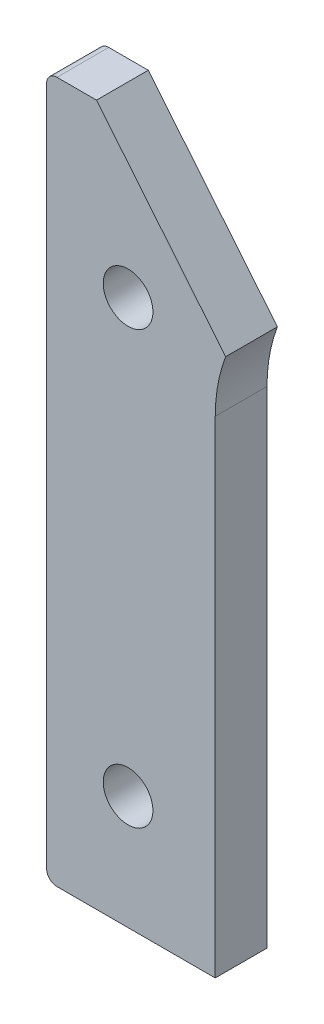
ISO-10303-21;
HEADER;
FILE_DESCRIPTION(('STEP AP214'),'2;1');
FILE_NAME('part.step','',(''),(''),'','','');
FILE_SCHEMA(('AUTOMOTIVE_DESIGN { 1 0 10303 214 1 1 1 1 }'));
ENDSEC;
DATA;
#1=APPLICATION_CONTEXT('core data for automotive mechanical design processes');
#2=APPLICATION_PROTOCOL_DEFINITION('international standard','automotive_design',2000,#1);
#3=PRODUCT_CONTEXT('',#1,'mechanical');
#4=PRODUCT('Part','Part','',(#3));
#5=PRODUCT_RELATED_PRODUCT_CATEGORY('part','',(#4));
#6=PRODUCT_DEFINITION_FORMATION('','',#4);
#7=PRODUCT_DEFINITION_CONTEXT('part definition',#1,'design');
#8=PRODUCT_DEFINITION('design','',#6,#7);
#9=PRODUCT_DEFINITION_SHAPE('','',#8);
#10=(LENGTH_UNIT() NAMED_UNIT(*) SI_UNIT(.MILLI.,.METRE.));
#11=(NAMED_UNIT(*) PLANE_ANGLE_UNIT() SI_UNIT($,.RADIAN.));
#12=(NAMED_UNIT(*) SI_UNIT($,.STERADIAN.) SOLID_ANGLE_UNIT());
#13=UNCERTAINTY_MEASURE_WITH_UNIT(LENGTH_MEASURE(1.E-05),#10,'distance_accuracy_value','');
#14=(GEOMETRIC_REPRESENTATION_CONTEXT(3) GLOBAL_UNCERTAINTY_ASSIGNED_CONTEXT((#13)) GLOBAL_UNIT_ASSIGNED_CONTEXT((#10,
#11,#12)) REPRESENTATION_CONTEXT('',''));
#15=CARTESIAN_POINT('',(0.,0.,0.));
#16=DIRECTION('',(0.,0.,1.));
#17=DIRECTION('',(1.,0.,0.));
#18=AXIS2_PLACEMENT_3D('',#15,#16,#17);
#19=CARTESIAN_POINT('',(-40.3774369352808,0.,6.35));
#20=DIRECTION('',(-1.,0.,0.));
#21=DIRECTION('',(0.,0.,1.));
#22=AXIS2_PLACEMENT_3D('',#19,#20,#21);
#23=PLANE('',#22);
#24=DIRECTION('',(0.,1.,0.));
#25=VECTOR('',#24,1.);
#26=CARTESIAN_POINT('',(-40.3774369352808,0.,0.));
#27=LINE('',#26,#25);
#28=CARTESIAN_POINT('',(-40.3774369352808,-58.42,0.));
#29=VERTEX_POINT('',#28);
#30=CARTESIAN_POINT('',(-40.3774369352808,25.0423969023602,0.));
#31=VERTEX_POINT('',#30);
#32=EDGE_CURVE('E153',#29,#31,#27,.T.);
#33=ORIENTED_EDGE('',*,*,#32,.F.);
#34=DIRECTION('',(0.,0.,-1.));
#35=VECTOR('',#34,1.);
#36=CARTESIAN_POINT('',(-40.3774369352808,-58.42,6.35));
#37=LINE('',#36,#35);
#38=CARTESIAN_POINT('',(-40.3774369352808,-58.42,6.35));
#39=VERTEX_POINT('',#38);
#40=EDGE_CURVE('E11',#39,#29,#37,.T.);
#41=ORIENTED_EDGE('',*,*,#40,.F.);
#42=DIRECTION('',(0.,1.,0.));
#43=VECTOR('',#42,1.);
#44=CARTESIAN_POINT('',(-40.3774369352808,0.,6.35));
#45=LINE('',#44,#43);
#46=CARTESIAN_POINT('',(-40.3774369352808,25.0423969023602,6.35));
#47=VERTEX_POINT('',#46);
#48=EDGE_CURVE('E188',#39,#47,#45,.T.);
#49=ORIENTED_EDGE('',*,*,#48,.T.);
#50=DIRECTION('',(0.,0.,-1.));
#51=VECTOR('',#50,1.);
#52=CARTESIAN_POINT('',(-40.3774369352808,25.0423969023602,6.35));
#53=LINE('',#52,#51);
#54=EDGE_CURVE('E62',#47,#31,#53,.T.);
#55=ORIENTED_EDGE('',*,*,#54,.T.);
#56=EDGE_LOOP('',(#33,#41,#49,#55));
#57=FACE_BOUND('',#56,.T.);
#58=ADVANCED_FACE('F45',(#57),#23,.T.);
#59=CARTESIAN_POINT('',(-39.1074369352808,-58.42,6.35));
#60=DIRECTION('',(0.,0.,-1.));
#61=DIRECTION('',(-1.,0.,0.));
#62=AXIS2_PLACEMENT_3D('',#59,#60,#61);
#63=CYLINDRICAL_SURFACE('',#62,1.27);
#64=CARTESIAN_POINT('',(-39.1074369352808,-58.42,0.));
#65=DIRECTION('',(0.,0.,1.));
#66=DIRECTION('',(1.,0.,0.));
#67=AXIS2_PLACEMENT_3D('',#64,#65,#66);
#68=CIRCLE('',#67,1.27);
#69=CARTESIAN_POINT('',(-39.1074369352808,-59.69,0.));
#70=VERTEX_POINT('',#69);
#71=EDGE_CURVE('E156',#29,#70,#68,.T.);
#72=ORIENTED_EDGE('',*,*,#71,.T.);
#73=DIRECTION('',(0.,0.,-1.));
#74=VECTOR('',#73,1.);
#75=CARTESIAN_POINT('',(-39.1074369352808,-59.69,6.35));
#76=LINE('',#75,#74);
#77=CARTESIAN_POINT('',(-39.1074369352808,-59.69,6.35));
#78=VERTEX_POINT('',#77);
#79=EDGE_CURVE('E54',#78,#70,#76,.T.);
#80=ORIENTED_EDGE('',*,*,#79,.F.);
#81=CARTESIAN_POINT('',(-39.1074369352808,-58.42,6.35));
#82=DIRECTION('',(0.,0.,1.));
#83=DIRECTION('',(1.,0.,0.));
#84=AXIS2_PLACEMENT_3D('',#81,#82,#83);
#85=CIRCLE('',#84,1.27);
#86=EDGE_CURVE('E224',#39,#78,#85,.T.);
#87=ORIENTED_EDGE('',*,*,#86,.F.);
#88=ORIENTED_EDGE('',*,*,#40,.T.);
#89=EDGE_LOOP('',(#72,#80,#87,#88));
#90=FACE_BOUND('',#89,.T.);
#91=ADVANCED_FACE('F245',(#90),#63,.T.);
#92=CARTESIAN_POINT('',(0.,-59.69,6.35));
#93=DIRECTION('',(0.,1.,0.));
#94=DIRECTION('',(0.,0.,1.));
#95=AXIS2_PLACEMENT_3D('',#92,#93,#94);
#96=PLANE('',#95);
#97=DIRECTION('',(1.,0.,0.));
#98=VECTOR('',#97,1.);
#99=CARTESIAN_POINT('',(0.,-59.69,0.));
#100=LINE('',#99,#98);
#101=CARTESIAN_POINT('',(-19.685,-59.69,0.));
#102=VERTEX_POINT('',#101);
#103=EDGE_CURVE('E159',#70,#102,#100,.T.);
#104=ORIENTED_EDGE('',*,*,#103,.T.);
#105=DIRECTION('',(0.,0.,-1.));
#106=VECTOR('',#105,1.);
#107=CARTESIAN_POINT('',(-19.685,-59.69,6.35));
#108=LINE('',#107,#106);
#109=CARTESIAN_POINT('',(-19.685,-59.69,6.35));
#110=VERTEX_POINT('',#109);
#111=EDGE_CURVE('E198',#110,#102,#108,.T.);
#112=ORIENTED_EDGE('',*,*,#111,.F.);
#113=DIRECTION('',(1.,0.,0.));
#114=VECTOR('',#113,1.);
#115=CARTESIAN_POINT('',(0.,-59.69,6.35));
#116=LINE('',#115,#114);
#117=EDGE_CURVE('E208',#78,#110,#116,.T.);
#118=ORIENTED_EDGE('',*,*,#117,.F.);
#119=ORIENTED_EDGE('',*,*,#79,.T.);
#120=EDGE_LOOP('',(#104,#112,#118,#119));
#121=FACE_BOUND('',#120,.T.);
#122=ADVANCED_FACE('F206',(#121),#96,.F.);
#123=CARTESIAN_POINT('',(-19.685,0.,6.35));
#124=DIRECTION('',(1.,0.,0.));
#125=DIRECTION('',(0.,1.,0.));
#126=AXIS2_PLACEMENT_3D('',#123,#124,#125);
#127=PLANE('',#126);
#128=DIRECTION('',(0.,-1.,0.));
#129=VECTOR('',#128,1.);
#130=CARTESIAN_POINT('',(-19.685,0.,0.));
#131=LINE('',#130,#129);
#132=CARTESIAN_POINT('',(-19.685,0.,0.));
#133=VERTEX_POINT('',#132);
#134=EDGE_CURVE('E163',#133,#102,#131,.T.);
#135=ORIENTED_EDGE('',*,*,#134,.F.);
#136=DIRECTION('',(0.,0.,-1.));
#137=VECTOR('',#136,1.);
#138=CARTESIAN_POINT('',(-19.685,0.,6.35));
#139=LINE('',#138,#137);
#140=CARTESIAN_POINT('',(-19.685,0.,6.35));
#141=VERTEX_POINT('',#140);
#142=EDGE_CURVE('E195',#141,#133,#139,.T.);
#143=ORIENTED_EDGE('',*,*,#142,.F.);
#144=DIRECTION('',(0.,-1.,0.));
#145=VECTOR('',#144,1.);
#146=CARTESIAN_POINT('',(-19.685,0.,6.35));
#147=LINE('',#146,#145);
#148=EDGE_CURVE('E219',#141,#110,#147,.T.);
#149=ORIENTED_EDGE('',*,*,#148,.T.);
#150=ORIENTED_EDGE('',*,*,#111,.T.);
#151=EDGE_LOOP('',(#135,#143,#149,#150));
#152=FACE_BOUND('',#151,.T.);
#153=ADVANCED_FACE('F217',(#152),#127,.T.);
#154=CARTESIAN_POINT('',(0.,0.,6.35));
#155=DIRECTION('',(0.,0.,-1.));
#156=DIRECTION('',(-1.,0.,0.));
#157=AXIS2_PLACEMENT_3D('',#154,#155,#156);
#158=CYLINDRICAL_SURFACE('',#157,19.685);
#159=CARTESIAN_POINT('',(0.,0.,0.));
#160=DIRECTION('',(0.,0.,1.));
#161=DIRECTION('',(1.,0.,0.));
#162=AXIS2_PLACEMENT_3D('',#159,#160,#161);
#163=CIRCLE('',#162,19.685);
#164=CARTESIAN_POINT('',(-18.409660073715,6.97019662350082,0.));
#165=VERTEX_POINT('',#164);
#166=EDGE_CURVE('E167',#165,#133,#163,.T.);
#167=ORIENTED_EDGE('',*,*,#166,.F.);
#168=DIRECTION('',(0.,0.,-1.));
#169=VECTOR('',#168,1.);
#170=CARTESIAN_POINT('',(-18.409660073715,6.97019662350082,6.35));
#171=LINE('',#170,#169);
#172=CARTESIAN_POINT('',(-18.409660073715,6.97019662350082,6.35));
#173=VERTEX_POINT('',#172);
#174=EDGE_CURVE('E122',#173,#165,#171,.T.);
#175=ORIENTED_EDGE('',*,*,#174,.F.);
#176=CARTESIAN_POINT('',(0.,0.,6.35));
#177=DIRECTION('',(0.,0.,1.));
#178=DIRECTION('',(1.,0.,0.));
#179=AXIS2_PLACEMENT_3D('',#176,#177,#178);
#180=CIRCLE('',#179,19.685);
#181=EDGE_CURVE('E134',#173,#141,#180,.T.);
#182=ORIENTED_EDGE('',*,*,#181,.T.);
#183=ORIENTED_EDGE('',*,*,#142,.T.);
#184=EDGE_LOOP('',(#167,#175,#182,#183));
#185=FACE_BOUND('',#184,.T.);
#186=ADVANCED_FACE('F256',(#185),#158,.F.);
#187=CARTESIAN_POINT('',(-7.60018366892684,-6.22571608684082,6.35));
#188=DIRECTION('',(0.77358881776472,0.633687889287292,0.));
#189=DIRECTION('',(-0.633687889287292,0.77358881776472,0.));
#190=AXIS2_PLACEMENT_3D('',#187,#188,#189);
#191=PLANE('',#190);
#192=DIRECTION('',(0.633687889287292,-0.77358881776472,0.));
#193=VECTOR('',#192,1.);
#194=CARTESIAN_POINT('',(-7.60018366892684,-6.22571608684082,0.));
#195=LINE('',#194,#193);
#196=CARTESIAN_POINT('',(-34.2538886708899,26.3123969023602,0.));
#197=VERTEX_POINT('',#196);
#198=EDGE_CURVE('E117',#197,#165,#195,.T.);
#199=ORIENTED_EDGE('',*,*,#198,.F.);
#200=DIRECTION('',(0.,0.,-1.));
#201=VECTOR('',#200,1.);
#202=CARTESIAN_POINT('',(-34.2538886708899,26.3123969023602,6.35));
#203=LINE('',#202,#201);
#204=CARTESIAN_POINT('',(-34.2538886708899,26.3123969023602,6.35));
#205=VERTEX_POINT('',#204);
#206=EDGE_CURVE('E112',#205,#197,#203,.T.);
#207=ORIENTED_EDGE('',*,*,#206,.F.);
#208=DIRECTION('',(0.633687889287292,-0.77358881776472,0.));
#209=VECTOR('',#208,1.);
#210=CARTESIAN_POINT('',(-7.60018366892684,-6.22571608684082,6.35));
#211=LINE('',#210,#209);
#212=EDGE_CURVE('E115',#205,#173,#211,.T.);
#213=ORIENTED_EDGE('',*,*,#212,.T.);
#214=ORIENTED_EDGE('',*,*,#174,.T.);
#215=EDGE_LOOP('',(#199,#207,#213,#214));
#216=FACE_BOUND('',#215,.T.);
#217=ADVANCED_FACE('F114',(#216),#191,.T.);
#218=CARTESIAN_POINT('',(0.,26.3123969023602,6.35));
#219=DIRECTION('',(0.,1.,0.));
#220=DIRECTION('',(0.,0.,1.));
#221=AXIS2_PLACEMENT_3D('',#218,#219,#220);
#222=PLANE('',#221);
#223=DIRECTION('',(1.,0.,0.));
#224=VECTOR('',#223,1.);
#225=CARTESIAN_POINT('',(0.,26.3123969023602,0.));
#226=LINE('',#225,#224);
#227=CARTESIAN_POINT('',(-39.1074369352808,26.3123969023602,0.));
#228=VERTEX_POINT('',#227);
#229=EDGE_CURVE('E173',#228,#197,#226,.T.);
#230=ORIENTED_EDGE('',*,*,#229,.F.);
#231=DIRECTION('',(0.,0.,-1.));
#232=VECTOR('',#231,1.);
#233=CARTESIAN_POINT('',(-39.1074369352808,26.3123969023602,6.35));
#234=LINE('',#233,#232);
#235=CARTESIAN_POINT('',(-39.1074369352808,26.3123969023602,6.35));
#236=VERTEX_POINT('',#235);
#237=EDGE_CURVE('E87',#236,#228,#234,.T.);
#238=ORIENTED_EDGE('',*,*,#237,.F.);
#239=DIRECTION('',(1.,0.,0.));
#240=VECTOR('',#239,1.);
#241=CARTESIAN_POINT('',(0.,26.3123969023602,6.35));
#242=LINE('',#241,#240);
#243=EDGE_CURVE('E131',#236,#205,#242,.T.);
#244=ORIENTED_EDGE('',*,*,#243,.T.);
#245=ORIENTED_EDGE('',*,*,#206,.T.);
#246=EDGE_LOOP('',(#230,#238,#244,#245));
#247=FACE_BOUND('',#246,.T.);
#248=ADVANCED_FACE('F137',(#247),#222,.T.);
#249=CARTESIAN_POINT('',(-30.3825369352808,7.26239690236022,6.35));
#250=DIRECTION('',(0.,0.,-1.));
#251=DIRECTION('',(-1.,0.,0.));
#252=AXIS2_PLACEMENT_3D('',#249,#250,#251);
#253=CYLINDRICAL_SURFACE('',#252,3.048);
#254=CARTESIAN_POINT('',(-30.3825369352808,7.26239690236022,6.35));
#255=DIRECTION('',(0.,0.,1.));
#256=DIRECTION('',(1.,0.,0.));
#257=AXIS2_PLACEMENT_3D('',#254,#255,#256);
#258=CIRCLE('',#257,3.048);
#259=CARTESIAN_POINT('',(-27.3345369352808,7.26239690236022,6.35));
#260=VERTEX_POINT('',#259);
#261=EDGE_CURVE('E142',#260,#260,#258,.T.);
#262=ORIENTED_EDGE('',*,*,#261,.T.);
#263=EDGE_LOOP('',(#262));
#264=FACE_BOUND('',#263,.T.);
#265=CARTESIAN_POINT('',(-30.3825369352808,7.26239690236022,0.));
#266=DIRECTION('',(0.,0.,1.));
#267=DIRECTION('',(1.,0.,0.));
#268=AXIS2_PLACEMENT_3D('',#265,#266,#267);
#269=CIRCLE('',#268,3.048);
#270=CARTESIAN_POINT('',(-27.3345369352808,7.26239690236022,0.));
#271=VERTEX_POINT('',#270);
#272=EDGE_CURVE('E180',#271,#271,#269,.T.);
#273=ORIENTED_EDGE('',*,*,#272,.F.);
#274=EDGE_LOOP('',(#273));
#275=FACE_BOUND('',#274,.T.);
#276=ADVANCED_FACE('F233',(#264,#275),#253,.F.);
#277=CARTESIAN_POINT('',(-39.1074369352808,25.0423969023602,6.35));
#278=DIRECTION('',(0.,0.,-1.));
#279=DIRECTION('',(-1.,0.,0.));
#280=AXIS2_PLACEMENT_3D('',#277,#278,#279);
#281=CYLINDRICAL_SURFACE('',#280,1.27);
#282=CARTESIAN_POINT('',(-39.1074369352808,25.0423969023602,0.));
#283=DIRECTION('',(0.,0.,1.));
#284=DIRECTION('',(1.,0.,0.));
#285=AXIS2_PLACEMENT_3D('',#282,#283,#284);
#286=CIRCLE('',#285,1.27);
#287=EDGE_CURVE('E176',#31,#228,#286,.F.);
#288=ORIENTED_EDGE('',*,*,#287,.F.);
#289=ORIENTED_EDGE('',*,*,#54,.F.);
#290=CARTESIAN_POINT('',(-39.1074369352808,25.0423969023602,6.35));
#291=DIRECTION('',(0.,0.,1.));
#292=DIRECTION('',(1.,0.,0.));
#293=AXIS2_PLACEMENT_3D('',#290,#291,#292);
#294=CIRCLE('',#293,1.27);
#295=EDGE_CURVE('E139',#47,#236,#294,.F.);
#296=ORIENTED_EDGE('',*,*,#295,.T.);
#297=ORIENTED_EDGE('',*,*,#237,.T.);
#298=EDGE_LOOP('',(#288,#289,#296,#297));
#299=FACE_BOUND('',#298,.T.);
#300=ADVANCED_FACE('F230',(#299),#281,.T.);
#301=CARTESIAN_POINT('',(-30.3825369352808,-45.72,6.35));
#302=DIRECTION('',(0.,0.,-1.));
#303=DIRECTION('',(-1.,0.,0.));
#304=AXIS2_PLACEMENT_3D('',#301,#302,#303);
#305=CYLINDRICAL_SURFACE('',#304,3.048);
#306=CARTESIAN_POINT('',(-30.3825369352808,-45.72,6.35));
#307=DIRECTION('',(0.,0.,1.));
#308=DIRECTION('',(1.,0.,0.));
#309=AXIS2_PLACEMENT_3D('',#306,#307,#308);
#310=CIRCLE('',#309,3.048);
#311=CARTESIAN_POINT('',(-27.3345369352808,-45.72,6.35));
#312=VERTEX_POINT('',#311);
#313=EDGE_CURVE('E149',#312,#312,#310,.T.);
#314=ORIENTED_EDGE('',*,*,#313,.T.);
#315=EDGE_LOOP('',(#314));
#316=FACE_BOUND('',#315,.T.);
#317=CARTESIAN_POINT('',(-30.3825369352808,-45.72,0.));
#318=DIRECTION('',(0.,0.,1.));
#319=DIRECTION('',(1.,0.,0.));
#320=AXIS2_PLACEMENT_3D('',#317,#318,#319);
#321=CIRCLE('',#320,3.048);
#322=CARTESIAN_POINT('',(-27.3345369352808,-45.72,0.));
#323=VERTEX_POINT('',#322);
#324=EDGE_CURVE('E184',#323,#323,#321,.T.);
#325=ORIENTED_EDGE('',*,*,#324,.F.);
#326=EDGE_LOOP('',(#325));
#327=FACE_BOUND('',#326,.T.);
#328=ADVANCED_FACE('F232',(#316,#327),#305,.F.);
#329=CARTESIAN_POINT('',(0.,0.,6.35));
#330=DIRECTION('',(0.,0.,1.));
#331=DIRECTION('',(1.,0.,0.));
#332=AXIS2_PLACEMENT_3D('',#329,#330,#331);
#333=PLANE('',#332);
#334=ORIENTED_EDGE('',*,*,#48,.F.);
#335=ORIENTED_EDGE('',*,*,#86,.T.);
#336=ORIENTED_EDGE('',*,*,#117,.T.);
#337=ORIENTED_EDGE('',*,*,#148,.F.);
#338=ORIENTED_EDGE('',*,*,#181,.F.);
#339=ORIENTED_EDGE('',*,*,#212,.F.);
#340=ORIENTED_EDGE('',*,*,#243,.F.);
#341=ORIENTED_EDGE('',*,*,#295,.F.);
#342=EDGE_LOOP('',(#334,#335,#336,#337,#338,#339,#340,#341));
#343=FACE_BOUND('',#342,.T.);
#344=ORIENTED_EDGE('',*,*,#261,.F.);
#345=EDGE_LOOP('',(#344));
#346=FACE_BOUND('',#345,.T.);
#347=ORIENTED_EDGE('',*,*,#313,.F.);
#348=EDGE_LOOP('',(#347));
#349=FACE_BOUND('',#348,.T.);
#350=ADVANCED_FACE('F128',(#343,#346,#349),#333,.T.);
#351=CARTESIAN_POINT('',(0.,0.,0.));
#352=DIRECTION('',(0.,0.,1.));
#353=DIRECTION('',(1.,0.,0.));
#354=AXIS2_PLACEMENT_3D('',#351,#352,#353);
#355=PLANE('',#354);
#356=ORIENTED_EDGE('',*,*,#32,.T.);
#357=ORIENTED_EDGE('',*,*,#287,.T.);
#358=ORIENTED_EDGE('',*,*,#229,.T.);
#359=ORIENTED_EDGE('',*,*,#198,.T.);
#360=ORIENTED_EDGE('',*,*,#166,.T.);
#361=ORIENTED_EDGE('',*,*,#134,.T.);
#362=ORIENTED_EDGE('',*,*,#103,.F.);
#363=ORIENTED_EDGE('',*,*,#71,.F.);
#364=EDGE_LOOP('',(#356,#357,#358,#359,#360,#361,#362,#363));
#365=FACE_BOUND('',#364,.T.);
#366=ORIENTED_EDGE('',*,*,#272,.T.);
#367=EDGE_LOOP('',(#366));
#368=FACE_BOUND('',#367,.T.);
#369=ORIENTED_EDGE('',*,*,#324,.T.);
#370=EDGE_LOOP('',(#369));
#371=FACE_BOUND('',#370,.T.);
#372=ADVANCED_FACE('F212',(#365,#368,#371),#355,.F.);
#373=CLOSED_SHELL('',(#58,#91,#122,#153,#186,#217,#248,#276,#300,#328,#350,#372));
#374=MANIFOLD_SOLID_BREP('B2',#373);
#375=ADVANCED_BREP_SHAPE_REPRESENTATION('',(#18,#374),#14);
#376=SHAPE_DEFINITION_REPRESENTATION(#9,#375);
ENDSEC;
END-ISO-10303-21;
